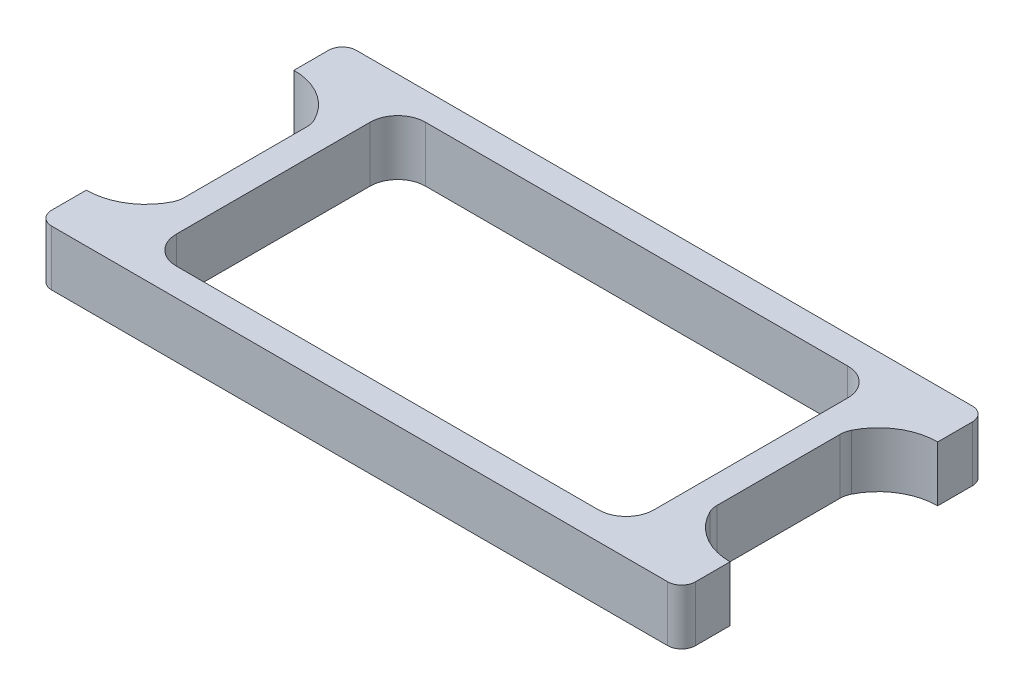
ISO-10303-21;
HEADER;
FILE_DESCRIPTION(('STEP AP214'),'2;1');
FILE_NAME('part.step','',(''),(''),'','','');
FILE_SCHEMA(('AUTOMOTIVE_DESIGN { 1 0 10303 214 1 1 1 1 }'));
ENDSEC;
DATA;
#1=APPLICATION_CONTEXT('core data for automotive mechanical design processes');
#2=APPLICATION_PROTOCOL_DEFINITION('international standard','automotive_design',2000,#1);
#3=PRODUCT_CONTEXT('',#1,'mechanical');
#4=PRODUCT('Part','Part','',(#3));
#5=PRODUCT_RELATED_PRODUCT_CATEGORY('part','',(#4));
#6=PRODUCT_DEFINITION_FORMATION('','',#4);
#7=PRODUCT_DEFINITION_CONTEXT('part definition',#1,'design');
#8=PRODUCT_DEFINITION('design','',#6,#7);
#9=PRODUCT_DEFINITION_SHAPE('','',#8);
#10=(LENGTH_UNIT() NAMED_UNIT(*) SI_UNIT(.MILLI.,.METRE.));
#11=(NAMED_UNIT(*) PLANE_ANGLE_UNIT() SI_UNIT($,.RADIAN.));
#12=(NAMED_UNIT(*) SI_UNIT($,.STERADIAN.) SOLID_ANGLE_UNIT());
#13=UNCERTAINTY_MEASURE_WITH_UNIT(LENGTH_MEASURE(1.E-05),#10,'distance_accuracy_value','');
#14=(GEOMETRIC_REPRESENTATION_CONTEXT(3) GLOBAL_UNCERTAINTY_ASSIGNED_CONTEXT((#13)) GLOBAL_UNIT_ASSIGNED_CONTEXT((#10,
#11,#12)) REPRESENTATION_CONTEXT('',''));
#15=CARTESIAN_POINT('',(0.,0.,0.));
#16=DIRECTION('',(0.,0.,1.));
#17=DIRECTION('',(1.,0.,0.));
#18=AXIS2_PLACEMENT_3D('',#15,#16,#17);
#19=CARTESIAN_POINT('',(46.5,8.,22.));
#20=DIRECTION('',(-1.,0.,0.));
#21=DIRECTION('',(0.,0.,1.));
#22=AXIS2_PLACEMENT_3D('',#19,#20,#21);
#23=PLANE('',#22);
#24=DIRECTION('',(0.,1.,0.));
#25=VECTOR('',#24,1.);
#26=CARTESIAN_POINT('',(46.5,0.,-15.));
#27=LINE('',#26,#25);
#28=CARTESIAN_POINT('',(46.5,0.,-15.));
#29=VERTEX_POINT('',#28);
#30=CARTESIAN_POINT('',(46.5,8.,-15.));
#31=VERTEX_POINT('',#30);
#32=EDGE_CURVE('E242',#29,#31,#27,.T.);
#33=ORIENTED_EDGE('',*,*,#32,.F.);
#34=DIRECTION('',(0.,0.,-1.));
#35=VECTOR('',#34,1.);
#36=CARTESIAN_POINT('',(46.5,0.,22.));
#37=LINE('',#36,#35);
#38=CARTESIAN_POINT('',(46.5,0.,-20.));
#39=VERTEX_POINT('',#38);
#40=EDGE_CURVE('E260',#29,#39,#37,.T.);
#41=ORIENTED_EDGE('',*,*,#40,.T.);
#42=DIRECTION('',(0.,-1.,0.));
#43=VECTOR('',#42,1.);
#44=CARTESIAN_POINT('',(46.5,8.,-20.));
#45=LINE('',#44,#43);
#46=CARTESIAN_POINT('',(46.5,8.,-20.));
#47=VERTEX_POINT('',#46);
#48=EDGE_CURVE('E367',#39,#47,#45,.F.);
#49=ORIENTED_EDGE('',*,*,#48,.T.);
#50=DIRECTION('',(0.,0.,-1.));
#51=VECTOR('',#50,1.);
#52=CARTESIAN_POINT('',(46.5,8.,22.));
#53=LINE('',#52,#51);
#54=EDGE_CURVE('E449',#31,#47,#53,.T.);
#55=ORIENTED_EDGE('',*,*,#54,.F.);
#56=EDGE_LOOP('',(#33,#41,#49,#55));
#57=FACE_BOUND('',#56,.T.);
#58=ADVANCED_FACE('F45',(#57),#23,.F.);
#59=DIRECTION('',(0.,1.,0.));
#60=VECTOR('',#59,1.);
#61=CARTESIAN_POINT('',(46.5,0.,15.));
#62=LINE('',#61,#60);
#63=CARTESIAN_POINT('',(46.5,0.,15.));
#64=VERTEX_POINT('',#63);
#65=CARTESIAN_POINT('',(46.5,8.,15.));
#66=VERTEX_POINT('',#65);
#67=EDGE_CURVE('E229',#64,#66,#62,.T.);
#68=ORIENTED_EDGE('',*,*,#67,.T.);
#69=CARTESIAN_POINT('',(46.5,8.,20.));
#70=VERTEX_POINT('',#69);
#71=EDGE_CURVE('E446',#70,#66,#53,.T.);
#72=ORIENTED_EDGE('',*,*,#71,.F.);
#73=DIRECTION('',(0.,-1.,0.));
#74=VECTOR('',#73,1.);
#75=CARTESIAN_POINT('',(46.5,8.,20.));
#76=LINE('',#75,#74);
#77=CARTESIAN_POINT('',(46.5,0.,20.));
#78=VERTEX_POINT('',#77);
#79=EDGE_CURVE('E257',#70,#78,#76,.T.);
#80=ORIENTED_EDGE('',*,*,#79,.T.);
#81=EDGE_CURVE('E247',#78,#64,#37,.T.);
#82=ORIENTED_EDGE('',*,*,#81,.T.);
#83=EDGE_LOOP('',(#68,#72,#80,#82));
#84=FACE_BOUND('',#83,.T.);
#85=ADVANCED_FACE('F255',(#84),#23,.F.);
#86=CARTESIAN_POINT('',(0.,8.,0.));
#87=DIRECTION('',(0.,1.,0.));
#88=DIRECTION('',(0.,0.,1.));
#89=AXIS2_PLACEMENT_3D('',#86,#87,#88);
#90=PLANE('',#89);
#91=DIRECTION('',(1.,0.,0.));
#92=VECTOR('',#91,1.);
#93=CARTESIAN_POINT('',(-34.5,8.,18.));
#94=LINE('',#93,#92);
#95=CARTESIAN_POINT('',(-30.5,8.,18.));
#96=VERTEX_POINT('',#95);
#97=CARTESIAN_POINT('',(30.5,8.,18.));
#98=VERTEX_POINT('',#97);
#99=EDGE_CURVE('E391',#96,#98,#94,.T.);
#100=ORIENTED_EDGE('',*,*,#99,.F.);
#101=CARTESIAN_POINT('',(-30.5,8.,14.));
#102=DIRECTION('',(0.,1.,0.));
#103=DIRECTION('',(0.,0.,1.));
#104=AXIS2_PLACEMENT_3D('',#101,#102,#103);
#105=CIRCLE('',#104,4.);
#106=CARTESIAN_POINT('',(-34.5,8.,14.));
#107=VERTEX_POINT('',#106);
#108=EDGE_CURVE('E312',#96,#107,#105,.F.);
#109=ORIENTED_EDGE('',*,*,#108,.T.);
#110=DIRECTION('',(0.,0.,1.));
#111=VECTOR('',#110,1.);
#112=CARTESIAN_POINT('',(-34.5,8.,-18.));
#113=LINE('',#112,#111);
#114=CARTESIAN_POINT('',(-34.5,8.,-14.));
#115=VERTEX_POINT('',#114);
#116=EDGE_CURVE('E463',#115,#107,#113,.T.);
#117=ORIENTED_EDGE('',*,*,#116,.F.);
#118=CARTESIAN_POINT('',(-30.5,8.,-14.));
#119=DIRECTION('',(0.,1.,0.));
#120=DIRECTION('',(0.,0.,1.));
#121=AXIS2_PLACEMENT_3D('',#118,#119,#120);
#122=CIRCLE('',#121,4.);
#123=CARTESIAN_POINT('',(-30.5,8.,-18.));
#124=VERTEX_POINT('',#123);
#125=EDGE_CURVE('E318',#115,#124,#122,.F.);
#126=ORIENTED_EDGE('',*,*,#125,.T.);
#127=DIRECTION('',(-1.,0.,0.));
#128=VECTOR('',#127,1.);
#129=CARTESIAN_POINT('',(34.5,8.,-18.));
#130=LINE('',#129,#128);
#131=CARTESIAN_POINT('',(30.5,8.,-18.));
#132=VERTEX_POINT('',#131);
#133=EDGE_CURVE('E498',#132,#124,#130,.T.);
#134=ORIENTED_EDGE('',*,*,#133,.F.);
#135=CARTESIAN_POINT('',(30.5,8.,-14.));
#136=DIRECTION('',(0.,1.,0.));
#137=DIRECTION('',(0.,0.,1.));
#138=AXIS2_PLACEMENT_3D('',#135,#136,#137);
#139=CIRCLE('',#138,4.);
#140=CARTESIAN_POINT('',(34.5,8.,-14.));
#141=VERTEX_POINT('',#140);
#142=EDGE_CURVE('E300',#132,#141,#139,.F.);
#143=ORIENTED_EDGE('',*,*,#142,.T.);
#144=DIRECTION('',(0.,0.,-1.));
#145=VECTOR('',#144,1.);
#146=CARTESIAN_POINT('',(34.5,8.,18.));
#147=LINE('',#146,#145);
#148=CARTESIAN_POINT('',(34.5,8.,14.));
#149=VERTEX_POINT('',#148);
#150=EDGE_CURVE('E495',#149,#141,#147,.T.);
#151=ORIENTED_EDGE('',*,*,#150,.F.);
#152=CARTESIAN_POINT('',(30.5,8.,14.));
#153=DIRECTION('',(0.,1.,0.));
#154=DIRECTION('',(0.,0.,1.));
#155=AXIS2_PLACEMENT_3D('',#152,#153,#154);
#156=CIRCLE('',#155,4.);
#157=EDGE_CURVE('E306',#149,#98,#156,.F.);
#158=ORIENTED_EDGE('',*,*,#157,.T.);
#159=EDGE_LOOP('',(#100,#109,#117,#126,#134,#143,#151,#158));
#160=FACE_BOUND('',#159,.T.);
#161=CARTESIAN_POINT('',(46.5,8.,6.41920896797299));
#162=DIRECTION('',(0.,1.,0.));
#163=DIRECTION('',(0.,0.,1.));
#164=AXIS2_PLACEMENT_3D('',#161,#162,#163);
#165=CIRCLE('',#164,8.58079103202701);
#166=CARTESIAN_POINT('',(38.8122089836516,8.,10.2307498669098));
#167=VERTEX_POINT('',#166);
#168=EDGE_CURVE('E236',#66,#167,#165,.F.);
#169=ORIENTED_EDGE('',*,*,#168,.T.);
#170=CARTESIAN_POINT('',(41.5,8.,8.89816611628216));
#171=DIRECTION('',(0.,1.,0.));
#172=DIRECTION('',(0.,0.,1.));
#173=AXIS2_PLACEMENT_3D('',#170,#171,#172);
#174=CIRCLE('',#173,3.);
#175=CARTESIAN_POINT('',(38.5,8.,8.89816611628216));
#176=VERTEX_POINT('',#175);
#177=EDGE_CURVE('E438',#167,#176,#174,.F.);
#178=ORIENTED_EDGE('',*,*,#177,.T.);
#179=DIRECTION('',(0.,0.,1.));
#180=VECTOR('',#179,1.);
#181=CARTESIAN_POINT('',(38.5,8.,0.));
#182=LINE('',#181,#180);
#183=CARTESIAN_POINT('',(38.5,8.,-8.89816611628216));
#184=VERTEX_POINT('',#183);
#185=EDGE_CURVE('E418',#176,#184,#182,.F.);
#186=ORIENTED_EDGE('',*,*,#185,.T.);
#187=CARTESIAN_POINT('',(41.5,8.,-8.89816611628216));
#188=DIRECTION('',(0.,1.,0.));
#189=DIRECTION('',(0.,0.,1.));
#190=AXIS2_PLACEMENT_3D('',#187,#188,#189);
#191=CIRCLE('',#190,3.);
#192=CARTESIAN_POINT('',(38.8122089836516,8.,-10.2307498669098));
#193=VERTEX_POINT('',#192);
#194=EDGE_CURVE('E54',#184,#193,#191,.F.);
#195=ORIENTED_EDGE('',*,*,#194,.T.);
#196=CARTESIAN_POINT('',(46.5,8.,-6.41920896797299));
#197=DIRECTION('',(0.,1.,0.));
#198=DIRECTION('',(0.,0.,1.));
#199=AXIS2_PLACEMENT_3D('',#196,#197,#198);
#200=CIRCLE('',#199,8.58079103202701);
#201=EDGE_CURVE('E423',#193,#31,#200,.F.);
#202=ORIENTED_EDGE('',*,*,#201,.T.);
#203=ORIENTED_EDGE('',*,*,#54,.T.);
#204=CARTESIAN_POINT('',(44.5,8.,-20.));
#205=DIRECTION('',(0.,1.,0.));
#206=DIRECTION('',(0.,0.,1.));
#207=AXIS2_PLACEMENT_3D('',#204,#205,#206);
#208=CIRCLE('',#207,2.);
#209=CARTESIAN_POINT('',(44.5,8.,-22.));
#210=VERTEX_POINT('',#209);
#211=EDGE_CURVE('E359',#47,#210,#208,.T.);
#212=ORIENTED_EDGE('',*,*,#211,.T.);
#213=DIRECTION('',(-1.,0.,0.));
#214=VECTOR('',#213,1.);
#215=CARTESIAN_POINT('',(46.5,8.,-22.));
#216=LINE('',#215,#214);
#217=CARTESIAN_POINT('',(-44.5,8.,-22.));
#218=VERTEX_POINT('',#217);
#219=EDGE_CURVE('E275',#210,#218,#216,.T.);
#220=ORIENTED_EDGE('',*,*,#219,.T.);
#221=CARTESIAN_POINT('',(-44.5,8.,-20.));
#222=DIRECTION('',(0.,1.,0.));
#223=DIRECTION('',(0.,0.,1.));
#224=AXIS2_PLACEMENT_3D('',#221,#222,#223);
#225=CIRCLE('',#224,2.);
#226=CARTESIAN_POINT('',(-46.5,8.,-20.));
#227=VERTEX_POINT('',#226);
#228=EDGE_CURVE('E362',#218,#227,#225,.T.);
#229=ORIENTED_EDGE('',*,*,#228,.T.);
#230=DIRECTION('',(0.,0.,1.));
#231=VECTOR('',#230,1.);
#232=CARTESIAN_POINT('',(-46.5,8.,22.));
#233=LINE('',#232,#231);
#234=CARTESIAN_POINT('',(-46.5,8.,-15.));
#235=VERTEX_POINT('',#234);
#236=EDGE_CURVE('E455',#227,#235,#233,.T.);
#237=ORIENTED_EDGE('',*,*,#236,.T.);
#238=CARTESIAN_POINT('',(-46.5,8.,-6.41920896797299));
#239=DIRECTION('',(0.,1.,0.));
#240=DIRECTION('',(0.,0.,1.));
#241=AXIS2_PLACEMENT_3D('',#238,#239,#240);
#242=CIRCLE('',#241,8.58079103202701);
#243=CARTESIAN_POINT('',(-38.8122089836516,8.,-10.2307498669098));
#244=VERTEX_POINT('',#243);
#245=EDGE_CURVE('E388',#244,#235,#242,.T.);
#246=ORIENTED_EDGE('',*,*,#245,.F.);
#247=CARTESIAN_POINT('',(-41.5,8.,-8.89816611628216));
#248=DIRECTION('',(0.,1.,0.));
#249=DIRECTION('',(0.,0.,1.));
#250=AXIS2_PLACEMENT_3D('',#247,#248,#249);
#251=CIRCLE('',#250,3.);
#252=CARTESIAN_POINT('',(-38.5,8.,-8.89816611628216));
#253=VERTEX_POINT('',#252);
#254=EDGE_CURVE('E411',#244,#253,#251,.F.);
#255=ORIENTED_EDGE('',*,*,#254,.T.);
#256=DIRECTION('',(0.,0.,-1.));
#257=VECTOR('',#256,1.);
#258=CARTESIAN_POINT('',(-38.5,8.,-9.52242902709144));
#259=LINE('',#258,#257);
#260=CARTESIAN_POINT('',(-38.5,8.,8.89816611628216));
#261=VERTEX_POINT('',#260);
#262=EDGE_CURVE('E383',#261,#253,#259,.T.);
#263=ORIENTED_EDGE('',*,*,#262,.F.);
#264=CARTESIAN_POINT('',(-41.5,8.,8.89816611628216));
#265=DIRECTION('',(0.,1.,0.));
#266=DIRECTION('',(0.,0.,1.));
#267=AXIS2_PLACEMENT_3D('',#264,#265,#266);
#268=CIRCLE('',#267,3.);
#269=CARTESIAN_POINT('',(-38.8122089836516,8.,10.2307498669098));
#270=VERTEX_POINT('',#269);
#271=EDGE_CURVE('E405',#261,#270,#268,.F.);
#272=ORIENTED_EDGE('',*,*,#271,.T.);
#273=CARTESIAN_POINT('',(-46.5,8.,6.41920896797299));
#274=DIRECTION('',(0.,1.,0.));
#275=DIRECTION('',(0.,0.,1.));
#276=AXIS2_PLACEMENT_3D('',#273,#274,#275);
#277=CIRCLE('',#276,8.58079103202701);
#278=CARTESIAN_POINT('',(-46.5,8.,15.));
#279=VERTEX_POINT('',#278);
#280=EDGE_CURVE('E379',#279,#270,#277,.T.);
#281=ORIENTED_EDGE('',*,*,#280,.F.);
#282=CARTESIAN_POINT('',(-46.5,8.,20.));
#283=VERTEX_POINT('',#282);
#284=EDGE_CURVE('E265',#279,#283,#233,.T.);
#285=ORIENTED_EDGE('',*,*,#284,.T.);
#286=CARTESIAN_POINT('',(-44.5,8.,20.));
#287=DIRECTION('',(0.,1.,0.));
#288=DIRECTION('',(0.,0.,1.));
#289=AXIS2_PLACEMENT_3D('',#286,#287,#288);
#290=CIRCLE('',#289,2.);
#291=CARTESIAN_POINT('',(-44.5,8.,22.));
#292=VERTEX_POINT('',#291);
#293=EDGE_CURVE('E356',#283,#292,#290,.T.);
#294=ORIENTED_EDGE('',*,*,#293,.T.);
#295=DIRECTION('',(1.,0.,0.));
#296=VECTOR('',#295,1.);
#297=CARTESIAN_POINT('',(46.5,8.,22.));
#298=LINE('',#297,#296);
#299=CARTESIAN_POINT('',(44.5,8.,22.));
#300=VERTEX_POINT('',#299);
#301=EDGE_CURVE('E452',#292,#300,#298,.T.);
#302=ORIENTED_EDGE('',*,*,#301,.T.);
#303=CARTESIAN_POINT('',(44.5,8.,20.));
#304=DIRECTION('',(0.,1.,0.));
#305=DIRECTION('',(0.,0.,1.));
#306=AXIS2_PLACEMENT_3D('',#303,#304,#305);
#307=CIRCLE('',#306,2.);
#308=EDGE_CURVE('E353',#300,#70,#307,.T.);
#309=ORIENTED_EDGE('',*,*,#308,.T.);
#310=ORIENTED_EDGE('',*,*,#71,.T.);
#311=EDGE_LOOP('',(#169,#178,#186,#195,#202,#203,#212,#220,#229,#237,#246,#255,#263,#272,#281,
#285,#294,#302,#309,#310));
#312=FACE_BOUND('',#311,.T.);
#313=ADVANCED_FACE('F554',(#160,#312),#90,.T.);
#314=CARTESIAN_POINT('',(0.,0.,0.));
#315=DIRECTION('',(0.,1.,0.));
#316=DIRECTION('',(0.,0.,1.));
#317=AXIS2_PLACEMENT_3D('',#314,#315,#316);
#318=PLANE('',#317);
#319=DIRECTION('',(-1.,0.,0.));
#320=VECTOR('',#319,1.);
#321=CARTESIAN_POINT('',(34.5,0.,-18.));
#322=LINE('',#321,#320);
#323=CARTESIAN_POINT('',(30.5,0.,-18.));
#324=VERTEX_POINT('',#323);
#325=CARTESIAN_POINT('',(-30.5,0.,-18.));
#326=VERTEX_POINT('',#325);
#327=EDGE_CURVE('E481',#324,#326,#322,.T.);
#328=ORIENTED_EDGE('',*,*,#327,.T.);
#329=CARTESIAN_POINT('',(-30.5,0.,-14.));
#330=DIRECTION('',(0.,1.,0.));
#331=DIRECTION('',(0.,0.,1.));
#332=AXIS2_PLACEMENT_3D('',#329,#330,#331);
#333=CIRCLE('',#332,4.);
#334=CARTESIAN_POINT('',(-34.5,0.,-14.));
#335=VERTEX_POINT('',#334);
#336=EDGE_CURVE('E321',#326,#335,#333,.T.);
#337=ORIENTED_EDGE('',*,*,#336,.T.);
#338=DIRECTION('',(0.,0.,1.));
#339=VECTOR('',#338,1.);
#340=CARTESIAN_POINT('',(-34.5,0.,-18.));
#341=LINE('',#340,#339);
#342=CARTESIAN_POINT('',(-34.5,0.,14.));
#343=VERTEX_POINT('',#342);
#344=EDGE_CURVE('E475',#335,#343,#341,.T.);
#345=ORIENTED_EDGE('',*,*,#344,.T.);
#346=CARTESIAN_POINT('',(-30.5,0.,14.));
#347=DIRECTION('',(0.,1.,0.));
#348=DIRECTION('',(0.,0.,1.));
#349=AXIS2_PLACEMENT_3D('',#346,#347,#348);
#350=CIRCLE('',#349,4.);
#351=CARTESIAN_POINT('',(-30.5,0.,18.));
#352=VERTEX_POINT('',#351);
#353=EDGE_CURVE('E315',#343,#352,#350,.T.);
#354=ORIENTED_EDGE('',*,*,#353,.T.);
#355=DIRECTION('',(1.,0.,0.));
#356=VECTOR('',#355,1.);
#357=CARTESIAN_POINT('',(-34.5,0.,18.));
#358=LINE('',#357,#356);
#359=CARTESIAN_POINT('',(30.5,0.,18.));
#360=VERTEX_POINT('',#359);
#361=EDGE_CURVE('E506',#352,#360,#358,.T.);
#362=ORIENTED_EDGE('',*,*,#361,.T.);
#363=CARTESIAN_POINT('',(30.5,0.,14.));
#364=DIRECTION('',(0.,1.,0.));
#365=DIRECTION('',(0.,0.,1.));
#366=AXIS2_PLACEMENT_3D('',#363,#364,#365);
#367=CIRCLE('',#366,4.);
#368=CARTESIAN_POINT('',(34.5,0.,14.));
#369=VERTEX_POINT('',#368);
#370=EDGE_CURVE('E309',#360,#369,#367,.T.);
#371=ORIENTED_EDGE('',*,*,#370,.T.);
#372=DIRECTION('',(0.,0.,-1.));
#373=VECTOR('',#372,1.);
#374=CARTESIAN_POINT('',(34.5,0.,18.));
#375=LINE('',#374,#373);
#376=CARTESIAN_POINT('',(34.5,0.,-14.));
#377=VERTEX_POINT('',#376);
#378=EDGE_CURVE('E488',#369,#377,#375,.T.);
#379=ORIENTED_EDGE('',*,*,#378,.T.);
#380=CARTESIAN_POINT('',(30.5,0.,-14.));
#381=DIRECTION('',(0.,1.,0.));
#382=DIRECTION('',(0.,0.,1.));
#383=AXIS2_PLACEMENT_3D('',#380,#381,#382);
#384=CIRCLE('',#383,4.);
#385=EDGE_CURVE('E303',#377,#324,#384,.T.);
#386=ORIENTED_EDGE('',*,*,#385,.T.);
#387=EDGE_LOOP('',(#328,#337,#345,#354,#362,#371,#379,#386));
#388=FACE_BOUND('',#387,.T.);
#389=CARTESIAN_POINT('',(46.5,0.,-6.41920896797299));
#390=DIRECTION('',(0.,-1.,0.));
#391=DIRECTION('',(0.,0.,-1.));
#392=AXIS2_PLACEMENT_3D('',#389,#390,#391);
#393=CIRCLE('',#392,8.58079103202701);
#394=CARTESIAN_POINT('',(38.8122089836516,0.,-10.2307498669098));
#395=VERTEX_POINT('',#394);
#396=EDGE_CURVE('E539',#395,#29,#393,.T.);
#397=ORIENTED_EDGE('',*,*,#396,.F.);
#398=CARTESIAN_POINT('',(41.5,0.,-8.89816611628216));
#399=DIRECTION('',(0.,1.,0.));
#400=DIRECTION('',(0.,0.,1.));
#401=AXIS2_PLACEMENT_3D('',#398,#399,#400);
#402=CIRCLE('',#401,3.);
#403=CARTESIAN_POINT('',(38.5,0.,-8.89816611628216));
#404=VERTEX_POINT('',#403);
#405=EDGE_CURVE('E11',#395,#404,#402,.T.);
#406=ORIENTED_EDGE('',*,*,#405,.T.);
#407=DIRECTION('',(0.,0.,-1.));
#408=VECTOR('',#407,1.);
#409=CARTESIAN_POINT('',(38.5,0.,-9.52242902709144));
#410=LINE('',#409,#408);
#411=CARTESIAN_POINT('',(38.5,0.,8.89816611628216));
#412=VERTEX_POINT('',#411);
#413=EDGE_CURVE('E252',#412,#404,#410,.T.);
#414=ORIENTED_EDGE('',*,*,#413,.F.);
#415=CARTESIAN_POINT('',(41.5,0.,8.89816611628216));
#416=DIRECTION('',(0.,1.,0.));
#417=DIRECTION('',(0.,0.,1.));
#418=AXIS2_PLACEMENT_3D('',#415,#416,#417);
#419=CIRCLE('',#418,3.);
#420=CARTESIAN_POINT('',(38.8122089836516,0.,10.2307498669098));
#421=VERTEX_POINT('',#420);
#422=EDGE_CURVE('E250',#412,#421,#419,.T.);
#423=ORIENTED_EDGE('',*,*,#422,.T.);
#424=CARTESIAN_POINT('',(46.5,0.,6.41920896797299));
#425=DIRECTION('',(0.,-1.,0.));
#426=DIRECTION('',(0.,0.,1.));
#427=AXIS2_PLACEMENT_3D('',#424,#425,#426);
#428=CIRCLE('',#427,8.58079103202701);
#429=EDGE_CURVE('E233',#64,#421,#428,.T.);
#430=ORIENTED_EDGE('',*,*,#429,.F.);
#431=ORIENTED_EDGE('',*,*,#81,.F.);
#432=CARTESIAN_POINT('',(44.5,0.,20.));
#433=DIRECTION('',(0.,1.,0.));
#434=DIRECTION('',(0.,0.,1.));
#435=AXIS2_PLACEMENT_3D('',#432,#433,#434);
#436=CIRCLE('',#435,2.);
#437=CARTESIAN_POINT('',(44.5,0.,22.));
#438=VERTEX_POINT('',#437);
#439=EDGE_CURVE('E332',#78,#438,#436,.F.);
#440=ORIENTED_EDGE('',*,*,#439,.T.);
#441=DIRECTION('',(1.,0.,0.));
#442=VECTOR('',#441,1.);
#443=CARTESIAN_POINT('',(46.5,0.,22.));
#444=LINE('',#443,#442);
#445=CARTESIAN_POINT('',(-44.5,0.,22.));
#446=VERTEX_POINT('',#445);
#447=EDGE_CURVE('E267',#446,#438,#444,.T.);
#448=ORIENTED_EDGE('',*,*,#447,.F.);
#449=CARTESIAN_POINT('',(-44.5,0.,20.));
#450=DIRECTION('',(0.,1.,0.));
#451=DIRECTION('',(0.,0.,1.));
#452=AXIS2_PLACEMENT_3D('',#449,#450,#451);
#453=CIRCLE('',#452,2.);
#454=CARTESIAN_POINT('',(-46.5,0.,20.));
#455=VERTEX_POINT('',#454);
#456=EDGE_CURVE('E335',#446,#455,#453,.F.);
#457=ORIENTED_EDGE('',*,*,#456,.T.);
#458=DIRECTION('',(0.,0.,1.));
#459=VECTOR('',#458,1.);
#460=CARTESIAN_POINT('',(-46.5,0.,22.));
#461=LINE('',#460,#459);
#462=CARTESIAN_POINT('',(-46.5,0.,15.));
#463=VERTEX_POINT('',#462);
#464=EDGE_CURVE('E468',#463,#455,#461,.T.);
#465=ORIENTED_EDGE('',*,*,#464,.F.);
#466=CARTESIAN_POINT('',(-46.5,0.,6.41920896797299));
#467=DIRECTION('',(0.,1.,0.));
#468=DIRECTION('',(0.,0.,1.));
#469=AXIS2_PLACEMENT_3D('',#466,#467,#468);
#470=CIRCLE('',#469,8.58079103202701);
#471=CARTESIAN_POINT('',(-38.8122089836516,0.,10.2307498669098));
#472=VERTEX_POINT('',#471);
#473=EDGE_CURVE('E527',#463,#472,#470,.T.);
#474=ORIENTED_EDGE('',*,*,#473,.T.);
#475=CARTESIAN_POINT('',(-41.5,0.,8.89816611628216));
#476=DIRECTION('',(0.,1.,0.));
#477=DIRECTION('',(0.,0.,1.));
#478=AXIS2_PLACEMENT_3D('',#475,#476,#477);
#479=CIRCLE('',#478,3.);
#480=CARTESIAN_POINT('',(-38.5,0.,8.89816611628216));
#481=VERTEX_POINT('',#480);
#482=EDGE_CURVE('E408',#472,#481,#479,.T.);
#483=ORIENTED_EDGE('',*,*,#482,.T.);
#484=DIRECTION('',(0.,0.,-1.));
#485=VECTOR('',#484,1.);
#486=CARTESIAN_POINT('',(-38.5,0.,-9.52242902709144));
#487=LINE('',#486,#485);
#488=CARTESIAN_POINT('',(-38.5,0.,-8.89816611628216));
#489=VERTEX_POINT('',#488);
#490=EDGE_CURVE('E523',#481,#489,#487,.T.);
#491=ORIENTED_EDGE('',*,*,#490,.T.);
#492=CARTESIAN_POINT('',(-41.5,0.,-8.89816611628216));
#493=DIRECTION('',(0.,1.,0.));
#494=DIRECTION('',(0.,0.,1.));
#495=AXIS2_PLACEMENT_3D('',#492,#493,#494);
#496=CIRCLE('',#495,3.);
#497=CARTESIAN_POINT('',(-38.8122089836516,0.,-10.2307498669098));
#498=VERTEX_POINT('',#497);
#499=EDGE_CURVE('E414',#489,#498,#496,.T.);
#500=ORIENTED_EDGE('',*,*,#499,.T.);
#501=CARTESIAN_POINT('',(-46.5,0.,-6.41920896797299));
#502=DIRECTION('',(0.,1.,0.));
#503=DIRECTION('',(0.,0.,-1.));
#504=AXIS2_PLACEMENT_3D('',#501,#502,#503);
#505=CIRCLE('',#504,8.58079103202701);
#506=CARTESIAN_POINT('',(-46.5,0.,-15.));
#507=VERTEX_POINT('',#506);
#508=EDGE_CURVE('E426',#498,#507,#505,.T.);
#509=ORIENTED_EDGE('',*,*,#508,.T.);
#510=CARTESIAN_POINT('',(-46.5,0.,-20.));
#511=VERTEX_POINT('',#510);
#512=EDGE_CURVE('E465',#511,#507,#461,.T.);
#513=ORIENTED_EDGE('',*,*,#512,.F.);
#514=CARTESIAN_POINT('',(-44.5,0.,-20.));
#515=DIRECTION('',(0.,1.,0.));
#516=DIRECTION('',(0.,0.,1.));
#517=AXIS2_PLACEMENT_3D('',#514,#515,#516);
#518=CIRCLE('',#517,2.);
#519=CARTESIAN_POINT('',(-44.5,0.,-22.));
#520=VERTEX_POINT('',#519);
#521=EDGE_CURVE('E343',#511,#520,#518,.F.);
#522=ORIENTED_EDGE('',*,*,#521,.T.);
#523=DIRECTION('',(-1.,0.,0.));
#524=VECTOR('',#523,1.);
#525=CARTESIAN_POINT('',(46.5,0.,-22.));
#526=LINE('',#525,#524);
#527=CARTESIAN_POINT('',(44.5,0.,-22.));
#528=VERTEX_POINT('',#527);
#529=EDGE_CURVE('E259',#528,#520,#526,.T.);
#530=ORIENTED_EDGE('',*,*,#529,.F.);
#531=CARTESIAN_POINT('',(44.5,0.,-20.));
#532=DIRECTION('',(0.,1.,0.));
#533=DIRECTION('',(0.,0.,1.));
#534=AXIS2_PLACEMENT_3D('',#531,#532,#533);
#535=CIRCLE('',#534,2.);
#536=EDGE_CURVE('E339',#528,#39,#535,.F.);
#537=ORIENTED_EDGE('',*,*,#536,.T.);
#538=ORIENTED_EDGE('',*,*,#40,.F.);
#539=EDGE_LOOP('',(#397,#406,#414,#423,#430,#431,#440,#448,#457,#465,#474,#483,#491,#500,#509,
#513,#522,#530,#537,#538));
#540=FACE_BOUND('',#539,.T.);
#541=ADVANCED_FACE('F246',(#388,#540),#318,.F.);
#542=CARTESIAN_POINT('',(-46.5,8.,22.));
#543=DIRECTION('',(1.,0.,0.));
#544=DIRECTION('',(0.,0.,-1.));
#545=AXIS2_PLACEMENT_3D('',#542,#543,#544);
#546=PLANE('',#545);
#547=ORIENTED_EDGE('',*,*,#512,.T.);
#548=DIRECTION('',(0.,1.,0.));
#549=VECTOR('',#548,1.);
#550=CARTESIAN_POINT('',(-46.5,0.,-15.));
#551=LINE('',#550,#549);
#552=EDGE_CURVE('E520',#507,#235,#551,.T.);
#553=ORIENTED_EDGE('',*,*,#552,.T.);
#554=ORIENTED_EDGE('',*,*,#236,.F.);
#555=DIRECTION('',(0.,-1.,0.));
#556=VECTOR('',#555,1.);
#557=CARTESIAN_POINT('',(-46.5,8.,-20.));
#558=LINE('',#557,#556);
#559=EDGE_CURVE('E328',#227,#511,#558,.T.);
#560=ORIENTED_EDGE('',*,*,#559,.T.);
#561=EDGE_LOOP('',(#547,#553,#554,#560));
#562=FACE_BOUND('',#561,.T.);
#563=ADVANCED_FACE('F564',(#562),#546,.F.);
#564=ORIENTED_EDGE('',*,*,#284,.F.);
#565=DIRECTION('',(0.,1.,0.));
#566=VECTOR('',#565,1.);
#567=CARTESIAN_POINT('',(-46.5,0.,15.));
#568=LINE('',#567,#566);
#569=EDGE_CURVE('E384',#463,#279,#568,.T.);
#570=ORIENTED_EDGE('',*,*,#569,.F.);
#571=ORIENTED_EDGE('',*,*,#464,.T.);
#572=DIRECTION('',(0.,-1.,0.));
#573=VECTOR('',#572,1.);
#574=CARTESIAN_POINT('',(-46.5,8.,20.));
#575=LINE('',#574,#573);
#576=EDGE_CURVE('E324',#455,#283,#575,.F.);
#577=ORIENTED_EDGE('',*,*,#576,.T.);
#578=EDGE_LOOP('',(#564,#570,#571,#577));
#579=FACE_BOUND('',#578,.T.);
#580=ADVANCED_FACE('F585',(#579),#546,.F.);
#581=CARTESIAN_POINT('',(46.5,8.,22.));
#582=DIRECTION('',(0.,0.,-1.));
#583=DIRECTION('',(-1.,0.,0.));
#584=AXIS2_PLACEMENT_3D('',#581,#582,#583);
#585=PLANE('',#584);
#586=ORIENTED_EDGE('',*,*,#301,.F.);
#587=DIRECTION('',(0.,-1.,0.));
#588=VECTOR('',#587,1.);
#589=CARTESIAN_POINT('',(-44.5,8.,22.));
#590=LINE('',#589,#588);
#591=EDGE_CURVE('E374',#292,#446,#590,.T.);
#592=ORIENTED_EDGE('',*,*,#591,.T.);
#593=ORIENTED_EDGE('',*,*,#447,.T.);
#594=DIRECTION('',(0.,-1.,0.));
#595=VECTOR('',#594,1.);
#596=CARTESIAN_POINT('',(44.5,8.,22.));
#597=LINE('',#596,#595);
#598=EDGE_CURVE('E371',#438,#300,#597,.F.);
#599=ORIENTED_EDGE('',*,*,#598,.T.);
#600=EDGE_LOOP('',(#586,#592,#593,#599));
#601=FACE_BOUND('',#600,.T.);
#602=ADVANCED_FACE('F595',(#601),#585,.F.);
#603=CARTESIAN_POINT('',(46.5,8.,-22.));
#604=DIRECTION('',(0.,0.,1.));
#605=DIRECTION('',(1.,0.,0.));
#606=AXIS2_PLACEMENT_3D('',#603,#604,#605);
#607=PLANE('',#606);
#608=ORIENTED_EDGE('',*,*,#529,.T.);
#609=DIRECTION('',(0.,-1.,0.));
#610=VECTOR('',#609,1.);
#611=CARTESIAN_POINT('',(-44.5,8.,-22.));
#612=LINE('',#611,#610);
#613=EDGE_CURVE('E350',#520,#218,#612,.F.);
#614=ORIENTED_EDGE('',*,*,#613,.T.);
#615=ORIENTED_EDGE('',*,*,#219,.F.);
#616=DIRECTION('',(0.,-1.,0.));
#617=VECTOR('',#616,1.);
#618=CARTESIAN_POINT('',(44.5,8.,-22.));
#619=LINE('',#618,#617);
#620=EDGE_CURVE('E346',#210,#528,#619,.T.);
#621=ORIENTED_EDGE('',*,*,#620,.T.);
#622=EDGE_LOOP('',(#608,#614,#615,#621));
#623=FACE_BOUND('',#622,.T.);
#624=ADVANCED_FACE('F557',(#623),#607,.F.);
#625=CARTESIAN_POINT('',(-34.5,0.,18.));
#626=DIRECTION('',(0.,0.,1.));
#627=DIRECTION('',(1.,0.,0.));
#628=AXIS2_PLACEMENT_3D('',#625,#626,#627);
#629=PLANE('',#628);
#630=ORIENTED_EDGE('',*,*,#99,.T.);
#631=DIRECTION('',(0.,1.,0.));
#632=VECTOR('',#631,1.);
#633=CARTESIAN_POINT('',(30.5,0.,18.));
#634=LINE('',#633,#632);
#635=EDGE_CURVE('E290',#98,#360,#634,.F.);
#636=ORIENTED_EDGE('',*,*,#635,.T.);
#637=ORIENTED_EDGE('',*,*,#361,.F.);
#638=DIRECTION('',(0.,1.,0.));
#639=VECTOR('',#638,1.);
#640=CARTESIAN_POINT('',(-30.5,8.,18.));
#641=LINE('',#640,#639);
#642=EDGE_CURVE('E286',#352,#96,#641,.T.);
#643=ORIENTED_EDGE('',*,*,#642,.T.);
#644=EDGE_LOOP('',(#630,#636,#637,#643));
#645=FACE_BOUND('',#644,.T.);
#646=ADVANCED_FACE('F673',(#645),#629,.F.);
#647=CARTESIAN_POINT('',(-34.5,0.,-18.));
#648=DIRECTION('',(-1.,0.,0.));
#649=DIRECTION('',(0.,0.,1.));
#650=AXIS2_PLACEMENT_3D('',#647,#648,#649);
#651=PLANE('',#650);
#652=ORIENTED_EDGE('',*,*,#116,.T.);
#653=DIRECTION('',(0.,1.,0.));
#654=VECTOR('',#653,1.);
#655=CARTESIAN_POINT('',(-34.5,0.,14.));
#656=LINE('',#655,#654);
#657=EDGE_CURVE('E297',#107,#343,#656,.F.);
#658=ORIENTED_EDGE('',*,*,#657,.T.);
#659=ORIENTED_EDGE('',*,*,#344,.F.);
#660=DIRECTION('',(0.,1.,0.));
#661=VECTOR('',#660,1.);
#662=CARTESIAN_POINT('',(-34.5,8.,-14.));
#663=LINE('',#662,#661);
#664=EDGE_CURVE('E293',#335,#115,#663,.T.);
#665=ORIENTED_EDGE('',*,*,#664,.T.);
#666=EDGE_LOOP('',(#652,#658,#659,#665));
#667=FACE_BOUND('',#666,.T.);
#668=ADVANCED_FACE('F669',(#667),#651,.F.);
#669=CARTESIAN_POINT('',(34.5,0.,-18.));
#670=DIRECTION('',(0.,0.,-1.));
#671=DIRECTION('',(-1.,0.,0.));
#672=AXIS2_PLACEMENT_3D('',#669,#670,#671);
#673=PLANE('',#672);
#674=ORIENTED_EDGE('',*,*,#327,.F.);
#675=DIRECTION('',(0.,1.,0.));
#676=VECTOR('',#675,1.);
#677=CARTESIAN_POINT('',(30.5,8.,-18.));
#678=LINE('',#677,#676);
#679=EDGE_CURVE('E274',#324,#132,#678,.T.);
#680=ORIENTED_EDGE('',*,*,#679,.T.);
#681=ORIENTED_EDGE('',*,*,#133,.T.);
#682=DIRECTION('',(0.,1.,0.));
#683=VECTOR('',#682,1.);
#684=CARTESIAN_POINT('',(-30.5,0.,-18.));
#685=LINE('',#684,#683);
#686=EDGE_CURVE('E271',#124,#326,#685,.F.);
#687=ORIENTED_EDGE('',*,*,#686,.T.);
#688=EDGE_LOOP('',(#674,#680,#681,#687));
#689=FACE_BOUND('',#688,.T.);
#690=ADVANCED_FACE('F672',(#689),#673,.F.);
#691=CARTESIAN_POINT('',(34.5,0.,18.));
#692=DIRECTION('',(1.,0.,0.));
#693=DIRECTION('',(0.,0.,-1.));
#694=AXIS2_PLACEMENT_3D('',#691,#692,#693);
#695=PLANE('',#694);
#696=ORIENTED_EDGE('',*,*,#150,.T.);
#697=DIRECTION('',(0.,1.,0.));
#698=VECTOR('',#697,1.);
#699=CARTESIAN_POINT('',(34.5,0.,-14.));
#700=LINE('',#699,#698);
#701=EDGE_CURVE('E283',#141,#377,#700,.F.);
#702=ORIENTED_EDGE('',*,*,#701,.T.);
#703=ORIENTED_EDGE('',*,*,#378,.F.);
#704=DIRECTION('',(0.,1.,0.));
#705=VECTOR('',#704,1.);
#706=CARTESIAN_POINT('',(34.5,8.,14.));
#707=LINE('',#706,#705);
#708=EDGE_CURVE('E279',#369,#149,#707,.T.);
#709=ORIENTED_EDGE('',*,*,#708,.T.);
#710=EDGE_LOOP('',(#696,#702,#703,#709));
#711=FACE_BOUND('',#710,.T.);
#712=ADVANCED_FACE('F631',(#711),#695,.F.);
#713=CARTESIAN_POINT('',(30.5,0.,-14.));
#714=DIRECTION('',(0.,-1.,0.));
#715=DIRECTION('',(0.,0.,-1.));
#716=AXIS2_PLACEMENT_3D('',#713,#714,#715);
#717=CYLINDRICAL_SURFACE('',#716,4.);
#718=ORIENTED_EDGE('',*,*,#385,.F.);
#719=ORIENTED_EDGE('',*,*,#701,.F.);
#720=ORIENTED_EDGE('',*,*,#142,.F.);
#721=ORIENTED_EDGE('',*,*,#679,.F.);
#722=EDGE_LOOP('',(#718,#719,#720,#721));
#723=FACE_BOUND('',#722,.T.);
#724=ADVANCED_FACE('F627',(#723),#717,.F.);
#725=CARTESIAN_POINT('',(30.5,0.,14.));
#726=DIRECTION('',(0.,-1.,0.));
#727=DIRECTION('',(0.,0.,-1.));
#728=AXIS2_PLACEMENT_3D('',#725,#726,#727);
#729=CYLINDRICAL_SURFACE('',#728,4.);
#730=ORIENTED_EDGE('',*,*,#370,.F.);
#731=ORIENTED_EDGE('',*,*,#635,.F.);
#732=ORIENTED_EDGE('',*,*,#157,.F.);
#733=ORIENTED_EDGE('',*,*,#708,.F.);
#734=EDGE_LOOP('',(#730,#731,#732,#733));
#735=FACE_BOUND('',#734,.T.);
#736=ADVANCED_FACE('F630',(#735),#729,.F.);
#737=CARTESIAN_POINT('',(-30.5,0.,14.));
#738=DIRECTION('',(0.,-1.,0.));
#739=DIRECTION('',(0.,0.,-1.));
#740=AXIS2_PLACEMENT_3D('',#737,#738,#739);
#741=CYLINDRICAL_SURFACE('',#740,4.);
#742=ORIENTED_EDGE('',*,*,#353,.F.);
#743=ORIENTED_EDGE('',*,*,#657,.F.);
#744=ORIENTED_EDGE('',*,*,#108,.F.);
#745=ORIENTED_EDGE('',*,*,#642,.F.);
#746=EDGE_LOOP('',(#742,#743,#744,#745));
#747=FACE_BOUND('',#746,.T.);
#748=ADVANCED_FACE('F635',(#747),#741,.F.);
#749=CARTESIAN_POINT('',(-30.5,0.,-14.));
#750=DIRECTION('',(0.,-1.,0.));
#751=DIRECTION('',(0.,0.,-1.));
#752=AXIS2_PLACEMENT_3D('',#749,#750,#751);
#753=CYLINDRICAL_SURFACE('',#752,4.);
#754=ORIENTED_EDGE('',*,*,#336,.F.);
#755=ORIENTED_EDGE('',*,*,#686,.F.);
#756=ORIENTED_EDGE('',*,*,#125,.F.);
#757=ORIENTED_EDGE('',*,*,#664,.F.);
#758=EDGE_LOOP('',(#754,#755,#756,#757));
#759=FACE_BOUND('',#758,.T.);
#760=ADVANCED_FACE('F639',(#759),#753,.F.);
#761=CARTESIAN_POINT('',(-44.5,8.,-20.));
#762=DIRECTION('',(0.,-1.,0.));
#763=DIRECTION('',(0.,0.,-1.));
#764=AXIS2_PLACEMENT_3D('',#761,#762,#763);
#765=CYLINDRICAL_SURFACE('',#764,2.);
#766=ORIENTED_EDGE('',*,*,#228,.F.);
#767=ORIENTED_EDGE('',*,*,#613,.F.);
#768=ORIENTED_EDGE('',*,*,#521,.F.);
#769=ORIENTED_EDGE('',*,*,#559,.F.);
#770=EDGE_LOOP('',(#766,#767,#768,#769));
#771=FACE_BOUND('',#770,.T.);
#772=ADVANCED_FACE('F560',(#771),#765,.T.);
#773=CARTESIAN_POINT('',(44.5,8.,-20.));
#774=DIRECTION('',(0.,-1.,0.));
#775=DIRECTION('',(0.,0.,-1.));
#776=AXIS2_PLACEMENT_3D('',#773,#774,#775);
#777=CYLINDRICAL_SURFACE('',#776,2.);
#778=ORIENTED_EDGE('',*,*,#211,.F.);
#779=ORIENTED_EDGE('',*,*,#48,.F.);
#780=ORIENTED_EDGE('',*,*,#536,.F.);
#781=ORIENTED_EDGE('',*,*,#620,.F.);
#782=EDGE_LOOP('',(#778,#779,#780,#781));
#783=FACE_BOUND('',#782,.T.);
#784=ADVANCED_FACE('F552',(#783),#777,.T.);
#785=CARTESIAN_POINT('',(-44.5,8.,20.));
#786=DIRECTION('',(0.,-1.,0.));
#787=DIRECTION('',(0.,0.,-1.));
#788=AXIS2_PLACEMENT_3D('',#785,#786,#787);
#789=CYLINDRICAL_SURFACE('',#788,2.);
#790=ORIENTED_EDGE('',*,*,#293,.F.);
#791=ORIENTED_EDGE('',*,*,#576,.F.);
#792=ORIENTED_EDGE('',*,*,#456,.F.);
#793=ORIENTED_EDGE('',*,*,#591,.F.);
#794=EDGE_LOOP('',(#790,#791,#792,#793));
#795=FACE_BOUND('',#794,.T.);
#796=ADVANCED_FACE('F591',(#795),#789,.T.);
#797=CARTESIAN_POINT('',(44.5,8.,20.));
#798=DIRECTION('',(0.,-1.,0.));
#799=DIRECTION('',(0.,0.,-1.));
#800=AXIS2_PLACEMENT_3D('',#797,#798,#799);
#801=CYLINDRICAL_SURFACE('',#800,2.);
#802=ORIENTED_EDGE('',*,*,#308,.F.);
#803=ORIENTED_EDGE('',*,*,#598,.F.);
#804=ORIENTED_EDGE('',*,*,#439,.F.);
#805=ORIENTED_EDGE('',*,*,#79,.F.);
#806=EDGE_LOOP('',(#802,#803,#804,#805));
#807=FACE_BOUND('',#806,.T.);
#808=ADVANCED_FACE('F598',(#807),#801,.T.);
#809=CARTESIAN_POINT('',(-46.5,0.,-6.41920896797299));
#810=DIRECTION('',(0.,1.,0.));
#811=DIRECTION('',(0.,0.,1.));
#812=AXIS2_PLACEMENT_3D('',#809,#810,#811);
#813=CYLINDRICAL_SURFACE('',#812,8.58079103202701);
#814=ORIENTED_EDGE('',*,*,#508,.F.);
#815=DIRECTION('',(0.,1.,0.));
#816=VECTOR('',#815,1.);
#817=CARTESIAN_POINT('',(-38.8122089836516,0.,-10.2307498669098));
#818=LINE('',#817,#816);
#819=EDGE_CURVE('E401',#498,#244,#818,.T.);
#820=ORIENTED_EDGE('',*,*,#819,.T.);
#821=ORIENTED_EDGE('',*,*,#245,.T.);
#822=ORIENTED_EDGE('',*,*,#552,.F.);
#823=EDGE_LOOP('',(#814,#820,#821,#822));
#824=FACE_BOUND('',#823,.T.);
#825=ADVANCED_FACE('F568',(#824),#813,.F.);
#826=CARTESIAN_POINT('',(-38.5,0.,-9.52242902709144));
#827=DIRECTION('',(1.,0.,0.));
#828=DIRECTION('',(0.,0.,-1.));
#829=AXIS2_PLACEMENT_3D('',#826,#827,#828);
#830=PLANE('',#829);
#831=ORIENTED_EDGE('',*,*,#490,.F.);
#832=DIRECTION('',(0.,-1.,0.));
#833=VECTOR('',#832,1.);
#834=CARTESIAN_POINT('',(-38.5,8.,8.89816611628216));
#835=LINE('',#834,#833);
#836=EDGE_CURVE('E394',#481,#261,#835,.F.);
#837=ORIENTED_EDGE('',*,*,#836,.T.);
#838=ORIENTED_EDGE('',*,*,#262,.T.);
#839=DIRECTION('',(0.,-1.,0.));
#840=VECTOR('',#839,1.);
#841=CARTESIAN_POINT('',(-38.5,0.,-8.89816611628216));
#842=LINE('',#841,#840);
#843=EDGE_CURVE('E378',#253,#489,#842,.T.);
#844=ORIENTED_EDGE('',*,*,#843,.T.);
#845=EDGE_LOOP('',(#831,#837,#838,#844));
#846=FACE_BOUND('',#845,.T.);
#847=ADVANCED_FACE('F575',(#846),#830,.F.);
#848=CARTESIAN_POINT('',(-46.5,0.,6.41920896797299));
#849=DIRECTION('',(0.,1.,0.));
#850=DIRECTION('',(0.,0.,1.));
#851=AXIS2_PLACEMENT_3D('',#848,#849,#850);
#852=CYLINDRICAL_SURFACE('',#851,8.58079103202701);
#853=ORIENTED_EDGE('',*,*,#280,.T.);
#854=DIRECTION('',(0.,1.,0.));
#855=VECTOR('',#854,1.);
#856=CARTESIAN_POINT('',(-38.8122089836516,0.,10.2307498669098));
#857=LINE('',#856,#855);
#858=EDGE_CURVE('E398',#270,#472,#857,.F.);
#859=ORIENTED_EDGE('',*,*,#858,.T.);
#860=ORIENTED_EDGE('',*,*,#473,.F.);
#861=ORIENTED_EDGE('',*,*,#569,.T.);
#862=EDGE_LOOP('',(#853,#859,#860,#861));
#863=FACE_BOUND('',#862,.T.);
#864=ADVANCED_FACE('F584',(#863),#852,.F.);
#865=CARTESIAN_POINT('',(-41.5,0.,8.89816611628216));
#866=DIRECTION('',(0.,1.,0.));
#867=DIRECTION('',(0.,0.,1.));
#868=AXIS2_PLACEMENT_3D('',#865,#866,#867);
#869=CYLINDRICAL_SURFACE('',#868,3.);
#870=ORIENTED_EDGE('',*,*,#482,.F.);
#871=ORIENTED_EDGE('',*,*,#858,.F.);
#872=ORIENTED_EDGE('',*,*,#271,.F.);
#873=ORIENTED_EDGE('',*,*,#836,.F.);
#874=EDGE_LOOP('',(#870,#871,#872,#873));
#875=FACE_BOUND('',#874,.T.);
#876=ADVANCED_FACE('F581',(#875),#869,.F.);
#877=CARTESIAN_POINT('',(-41.5,0.,-8.89816611628216));
#878=DIRECTION('',(0.,1.,0.));
#879=DIRECTION('',(0.,0.,1.));
#880=AXIS2_PLACEMENT_3D('',#877,#878,#879);
#881=CYLINDRICAL_SURFACE('',#880,3.);
#882=ORIENTED_EDGE('',*,*,#499,.F.);
#883=ORIENTED_EDGE('',*,*,#843,.F.);
#884=ORIENTED_EDGE('',*,*,#254,.F.);
#885=ORIENTED_EDGE('',*,*,#819,.F.);
#886=EDGE_LOOP('',(#882,#883,#884,#885));
#887=FACE_BOUND('',#886,.T.);
#888=ADVANCED_FACE('F578',(#887),#881,.F.);
#889=CARTESIAN_POINT('',(46.5,0.,-6.41920896797299));
#890=DIRECTION('',(0.,1.,0.));
#891=DIRECTION('',(0.,0.,1.));
#892=AXIS2_PLACEMENT_3D('',#889,#890,#891);
#893=CYLINDRICAL_SURFACE('',#892,8.58079103202701);
#894=ORIENTED_EDGE('',*,*,#201,.F.);
#895=DIRECTION('',(0.,1.,0.));
#896=VECTOR('',#895,1.);
#897=CARTESIAN_POINT('',(38.8122089836516,0.,-10.2307498669098));
#898=LINE('',#897,#896);
#899=EDGE_CURVE('E67',#193,#395,#898,.F.);
#900=ORIENTED_EDGE('',*,*,#899,.T.);
#901=ORIENTED_EDGE('',*,*,#396,.T.);
#902=ORIENTED_EDGE('',*,*,#32,.T.);
#903=EDGE_LOOP('',(#894,#900,#901,#902));
#904=FACE_BOUND('',#903,.T.);
#905=ADVANCED_FACE('F542',(#904),#893,.F.);
#906=CARTESIAN_POINT('',(46.5,0.,6.41920896797299));
#907=DIRECTION('',(0.,1.,0.));
#908=DIRECTION('',(0.,0.,1.));
#909=AXIS2_PLACEMENT_3D('',#906,#907,#908);
#910=CYLINDRICAL_SURFACE('',#909,8.58079103202701);
#911=ORIENTED_EDGE('',*,*,#429,.T.);
#912=DIRECTION('',(0.,1.,0.));
#913=VECTOR('',#912,1.);
#914=CARTESIAN_POINT('',(38.8122089836516,0.,10.2307498669098));
#915=LINE('',#914,#913);
#916=EDGE_CURVE('E417',#421,#167,#915,.T.);
#917=ORIENTED_EDGE('',*,*,#916,.T.);
#918=ORIENTED_EDGE('',*,*,#168,.F.);
#919=ORIENTED_EDGE('',*,*,#67,.F.);
#920=EDGE_LOOP('',(#911,#917,#918,#919));
#921=FACE_BOUND('',#920,.T.);
#922=ADVANCED_FACE('F231',(#921),#910,.F.);
#923=CARTESIAN_POINT('',(38.5,0.,-9.52242902709144));
#924=DIRECTION('',(1.,0.,0.));
#925=DIRECTION('',(0.,0.,-1.));
#926=AXIS2_PLACEMENT_3D('',#923,#924,#925);
#927=PLANE('',#926);
#928=ORIENTED_EDGE('',*,*,#185,.F.);
#929=DIRECTION('',(0.,-1.,0.));
#930=VECTOR('',#929,1.);
#931=CARTESIAN_POINT('',(38.5,0.,8.89816611628216));
#932=LINE('',#931,#930);
#933=EDGE_CURVE('E433',#176,#412,#932,.T.);
#934=ORIENTED_EDGE('',*,*,#933,.T.);
#935=ORIENTED_EDGE('',*,*,#413,.T.);
#936=DIRECTION('',(0.,-1.,0.));
#937=VECTOR('',#936,1.);
#938=CARTESIAN_POINT('',(38.5,8.,-8.89816611628216));
#939=LINE('',#938,#937);
#940=EDGE_CURVE('E429',#404,#184,#939,.F.);
#941=ORIENTED_EDGE('',*,*,#940,.T.);
#942=EDGE_LOOP('',(#928,#934,#935,#941));
#943=FACE_BOUND('',#942,.T.);
#944=ADVANCED_FACE('F603',(#943),#927,.T.);
#945=CARTESIAN_POINT('',(41.5,0.,8.89816611628216));
#946=DIRECTION('',(0.,1.,0.));
#947=DIRECTION('',(0.,0.,1.));
#948=AXIS2_PLACEMENT_3D('',#945,#946,#947);
#949=CYLINDRICAL_SURFACE('',#948,3.);
#950=ORIENTED_EDGE('',*,*,#422,.F.);
#951=ORIENTED_EDGE('',*,*,#933,.F.);
#952=ORIENTED_EDGE('',*,*,#177,.F.);
#953=ORIENTED_EDGE('',*,*,#916,.F.);
#954=EDGE_LOOP('',(#950,#951,#952,#953));
#955=FACE_BOUND('',#954,.T.);
#956=ADVANCED_FACE('F605',(#955),#949,.F.);
#957=CARTESIAN_POINT('',(41.5,0.,-8.89816611628216));
#958=DIRECTION('',(0.,1.,0.));
#959=DIRECTION('',(0.,0.,1.));
#960=AXIS2_PLACEMENT_3D('',#957,#958,#959);
#961=CYLINDRICAL_SURFACE('',#960,3.);
#962=ORIENTED_EDGE('',*,*,#405,.F.);
#963=ORIENTED_EDGE('',*,*,#899,.F.);
#964=ORIENTED_EDGE('',*,*,#194,.F.);
#965=ORIENTED_EDGE('',*,*,#940,.F.);
#966=EDGE_LOOP('',(#962,#963,#964,#965));
#967=FACE_BOUND('',#966,.T.);
#968=ADVANCED_FACE('F47',(#967),#961,.F.);
#969=CLOSED_SHELL('',(#58,#85,#313,#541,#563,#580,#602,#624,#646,#668,#690,#712,#724,#736,#748,
#760,#772,#784,#796,#808,#825,#847,#864,#876,#888,#905,#922,#944,#956,#968));
#970=MANIFOLD_SOLID_BREP('B2',#969);
#971=ADVANCED_BREP_SHAPE_REPRESENTATION('',(#18,#970),#14);
#972=SHAPE_DEFINITION_REPRESENTATION(#9,#971);
ENDSEC;
END-ISO-10303-21;
